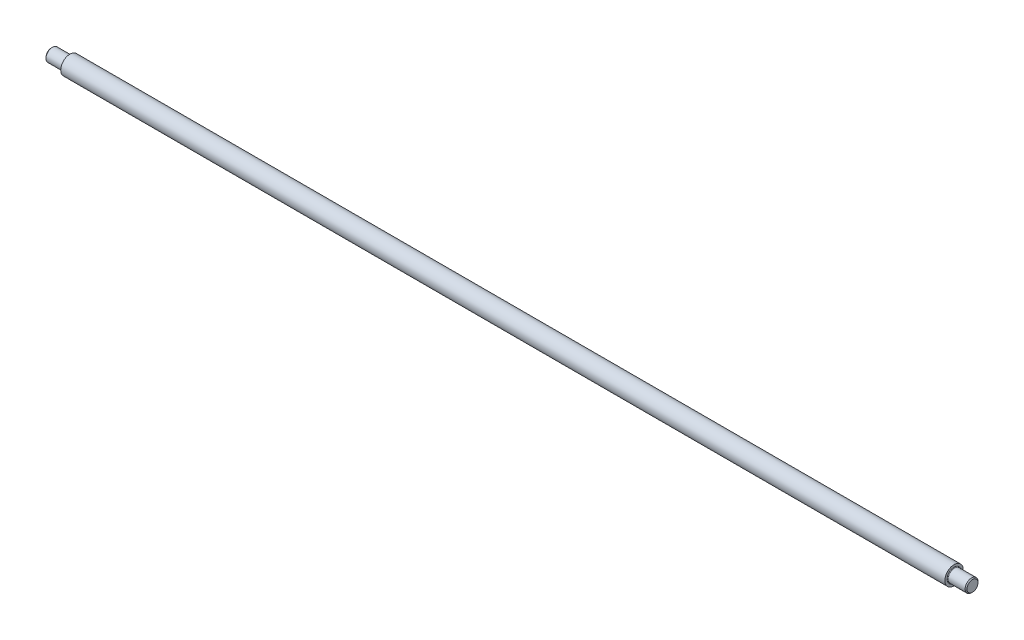
ISO-10303-21;
HEADER;
FILE_DESCRIPTION(('STEP AP214'),'2;1');
FILE_NAME('part.step','',(''),(''),'','','');
FILE_SCHEMA(('AUTOMOTIVE_DESIGN { 1 0 10303 214 1 1 1 1 }'));
ENDSEC;
DATA;
#1=APPLICATION_CONTEXT('core data for automotive mechanical design processes');
#2=APPLICATION_PROTOCOL_DEFINITION('international standard','automotive_design',2000,#1);
#3=PRODUCT_CONTEXT('',#1,'mechanical');
#4=PRODUCT('Part','Part','',(#3));
#5=PRODUCT_RELATED_PRODUCT_CATEGORY('part','',(#4));
#6=PRODUCT_DEFINITION_FORMATION('','',#4);
#7=PRODUCT_DEFINITION_CONTEXT('part definition',#1,'design');
#8=PRODUCT_DEFINITION('design','',#6,#7);
#9=PRODUCT_DEFINITION_SHAPE('','',#8);
#10=(LENGTH_UNIT() NAMED_UNIT(*) SI_UNIT(.MILLI.,.METRE.));
#11=(NAMED_UNIT(*) PLANE_ANGLE_UNIT() SI_UNIT($,.RADIAN.));
#12=(NAMED_UNIT(*) SI_UNIT($,.STERADIAN.) SOLID_ANGLE_UNIT());
#13=UNCERTAINTY_MEASURE_WITH_UNIT(LENGTH_MEASURE(1.E-05),#10,'distance_accuracy_value','');
#14=(GEOMETRIC_REPRESENTATION_CONTEXT(3) GLOBAL_UNCERTAINTY_ASSIGNED_CONTEXT((#13)) GLOBAL_UNIT_ASSIGNED_CONTEXT((#10,
#11,#12)) REPRESENTATION_CONTEXT('',''));
#15=CARTESIAN_POINT('',(0.,0.,0.));
#16=DIRECTION('',(0.,0.,1.));
#17=DIRECTION('',(1.,0.,0.));
#18=AXIS2_PLACEMENT_3D('',#15,#16,#17);
#19=CARTESIAN_POINT('',(10.,-5.,5.));
#20=DIRECTION('',(-1.,0.,0.));
#21=DIRECTION('',(0.,1.,0.));
#22=AXIS2_PLACEMENT_3D('',#19,#20,#21);
#23=PLANE('',#22);
#24=CARTESIAN_POINT('',(10.,0.,0.));
#25=DIRECTION('',(-1.,0.,0.));
#26=DIRECTION('',(0.,0.,-1.));
#27=AXIS2_PLACEMENT_3D('',#24,#25,#26);
#28=CIRCLE('',#27,5.);
#29=CARTESIAN_POINT('',(10.,0.,-5.));
#30=VERTEX_POINT('',#29);
#31=EDGE_CURVE('E50',#30,#30,#28,.F.);
#32=ORIENTED_EDGE('',*,*,#31,.F.);
#33=EDGE_LOOP('',(#32));
#34=FACE_BOUND('',#33,.T.);
#35=CARTESIAN_POINT('',(10.,0.,0.));
#36=DIRECTION('',(1.,0.,0.));
#37=DIRECTION('',(0.,-1.42053919504589E-07,0.99999999999999));
#38=AXIS2_PLACEMENT_3D('',#35,#36,#37);
#39=CIRCLE('',#38,3.79999999999989);
#40=CARTESIAN_POINT('',(10.,-5.39804894117424E-07,3.79999999999985));
#41=VERTEX_POINT('',#40);
#42=EDGE_CURVE('E47',#41,#41,#39,.T.);
#43=ORIENTED_EDGE('',*,*,#42,.T.);
#44=EDGE_LOOP('',(#43));
#45=FACE_BOUND('',#44,.T.);
#46=ADVANCED_FACE('F15',(#34,#45),#23,.T.);
#47=CARTESIAN_POINT('',(490.,-4.99999975829996,-5.00000000000001));
#48=DIRECTION('',(1.,0.,0.));
#49=DIRECTION('',(0.,1.,0.));
#50=AXIS2_PLACEMENT_3D('',#47,#48,#49);
#51=PLANE('',#50);
#52=CARTESIAN_POINT('',(490.,0.,0.));
#53=DIRECTION('',(1.,0.,0.));
#54=DIRECTION('',(0.,-1.41721898572201E-07,0.99999999999999));
#55=AXIS2_PLACEMENT_3D('',#52,#53,#54);
#56=CIRCLE('',#55,5.);
#57=CARTESIAN_POINT('',(490.,-7.08609492861005E-07,4.99999999999995));
#58=VERTEX_POINT('',#57);
#59=EDGE_CURVE('E44',#58,#58,#56,.T.);
#60=ORIENTED_EDGE('',*,*,#59,.T.);
#61=EDGE_LOOP('',(#60));
#62=FACE_BOUND('',#61,.T.);
#63=CARTESIAN_POINT('',(490.,0.,0.));
#64=DIRECTION('',(-1.,0.,0.));
#65=DIRECTION('',(0.,0.,-1.));
#66=AXIS2_PLACEMENT_3D('',#63,#64,#65);
#67=CIRCLE('',#66,3.80000037178537);
#68=CARTESIAN_POINT('',(490.,0.,-3.80000037178537));
#69=VERTEX_POINT('',#68);
#70=EDGE_CURVE('E41',#69,#69,#67,.F.);
#71=ORIENTED_EDGE('',*,*,#70,.F.);
#72=EDGE_LOOP('',(#71));
#73=FACE_BOUND('',#72,.T.);
#74=ADVANCED_FACE('F58',(#62,#73),#51,.T.);
#75=CARTESIAN_POINT('',(0.,-3.,3.));
#76=DIRECTION('',(-1.,0.,0.));
#77=DIRECTION('',(0.,1.,0.));
#78=AXIS2_PLACEMENT_3D('',#75,#76,#77);
#79=PLANE('',#78);
#80=CARTESIAN_POINT('',(0.,0.,0.));
#81=DIRECTION('',(-1.,0.,0.));
#82=DIRECTION('',(0.,0.,-1.));
#83=AXIS2_PLACEMENT_3D('',#80,#81,#82);
#84=CIRCLE('',#83,3.);
#85=CARTESIAN_POINT('',(0.,0.,-3.));
#86=VERTEX_POINT('',#85);
#87=EDGE_CURVE('E38',#86,#86,#84,.F.);
#88=ORIENTED_EDGE('',*,*,#87,.F.);
#89=EDGE_LOOP('',(#88));
#90=FACE_BOUND('',#89,.T.);
#91=ADVANCED_FACE('F81',(#90),#79,.T.);
#92=CARTESIAN_POINT('',(500.,-2.99999985477205,-2.9999999999999));
#93=DIRECTION('',(1.,0.,0.));
#94=DIRECTION('',(0.,1.,0.));
#95=AXIS2_PLACEMENT_3D('',#92,#93,#94);
#96=PLANE('',#95);
#97=CARTESIAN_POINT('',(500.,0.,0.));
#98=DIRECTION('',(1.,0.,0.));
#99=DIRECTION('',(0.,-1.41924996939959E-07,0.99999999999999));
#100=AXIS2_PLACEMENT_3D('',#97,#98,#99);
#101=CIRCLE('',#100,2.9999999999999);
#102=CARTESIAN_POINT('',(500.,-4.25774990819863E-07,2.99999999999987));
#103=VERTEX_POINT('',#102);
#104=EDGE_CURVE('E35',#103,#103,#101,.T.);
#105=ORIENTED_EDGE('',*,*,#104,.T.);
#106=EDGE_LOOP('',(#105));
#107=FACE_BOUND('',#106,.T.);
#108=ADVANCED_FACE('F83',(#107),#96,.T.);
#109=CARTESIAN_POINT('',(490.,0.,0.));
#110=DIRECTION('',(1.,0.,0.));
#111=DIRECTION('',(0.,0.,1.));
#112=AXIS2_PLACEMENT_3D('',#109,#110,#111);
#113=CYLINDRICAL_SURFACE('',#112,5.);
#114=ORIENTED_EDGE('',*,*,#59,.F.);
#115=EDGE_LOOP('',(#114));
#116=FACE_BOUND('',#115,.T.);
#117=ORIENTED_EDGE('',*,*,#31,.T.);
#118=EDGE_LOOP('',(#117));
#119=FACE_BOUND('',#118,.T.);
#120=ADVANCED_FACE('F54',(#116,#119),#113,.T.);
#121=CARTESIAN_POINT('',(0.5,0.,0.));
#122=DIRECTION('',(1.,0.,0.));
#123=DIRECTION('',(0.,1.92336047429162E-10,1.));
#124=AXIS2_PLACEMENT_3D('',#121,#122,#123);
#125=CONICAL_SURFACE('',#124,3.5,0.785398163397448);
#126=CARTESIAN_POINT('',(0.5,0.,0.));
#127=DIRECTION('',(-1.,0.,0.));
#128=DIRECTION('',(0.,0.,-1.));
#129=AXIS2_PLACEMENT_3D('',#126,#127,#128);
#130=CIRCLE('',#129,3.5);
#131=CARTESIAN_POINT('',(0.5,0.,-3.5));
#132=VERTEX_POINT('',#131);
#133=EDGE_CURVE('E30',#132,#132,#130,.F.);
#134=ORIENTED_EDGE('',*,*,#133,.F.);
#135=EDGE_LOOP('',(#134));
#136=FACE_BOUND('',#135,.T.);
#137=ORIENTED_EDGE('',*,*,#87,.T.);
#138=EDGE_LOOP('',(#137));
#139=FACE_BOUND('',#138,.T.);
#140=ADVANCED_FACE('F72',(#136,#139),#125,.T.);
#141=CARTESIAN_POINT('',(10.,0.,0.));
#142=DIRECTION('',(1.,0.,0.));
#143=DIRECTION('',(0.,7.69342934144187E-10,1.));
#144=AXIS2_PLACEMENT_3D('',#141,#142,#143);
#145=CYLINDRICAL_SURFACE('',#144,3.5);
#146=CARTESIAN_POINT('',(9.7,0.,0.));
#147=DIRECTION('',(-1.,0.,0.));
#148=DIRECTION('',(0.,0.,-1.));
#149=AXIS2_PLACEMENT_3D('',#146,#147,#148);
#150=CIRCLE('',#149,3.5);
#151=CARTESIAN_POINT('',(9.7,0.,-3.5));
#152=VERTEX_POINT('',#151);
#153=EDGE_CURVE('E26',#152,#152,#150,.F.);
#154=ORIENTED_EDGE('',*,*,#153,.F.);
#155=EDGE_LOOP('',(#154));
#156=FACE_BOUND('',#155,.T.);
#157=ORIENTED_EDGE('',*,*,#133,.T.);
#158=EDGE_LOOP('',(#157));
#159=FACE_BOUND('',#158,.T.);
#160=ADVANCED_FACE('F66',(#156,#159),#145,.T.);
#161=CARTESIAN_POINT('',(9.70000000000012,0.,0.));
#162=DIRECTION('',(1.,0.,0.));
#163=DIRECTION('',(0.,0.,1.));
#164=AXIS2_PLACEMENT_3D('',#161,#162,#163);
#165=TOROIDAL_SURFACE('',#164,3.79999999999988,0.299999999999876);
#166=ORIENTED_EDGE('',*,*,#42,.F.);
#167=EDGE_LOOP('',(#166));
#168=FACE_BOUND('',#167,.T.);
#169=ORIENTED_EDGE('',*,*,#153,.T.);
#170=EDGE_LOOP('',(#169));
#171=FACE_BOUND('',#170,.T.);
#172=ADVANCED_FACE('F62',(#168,#171),#165,.F.);
#173=CARTESIAN_POINT('',(490.299999999993,0.,0.));
#174=DIRECTION('',(1.,0.,0.));
#175=DIRECTION('',(0.,0.,1.));
#176=AXIS2_PLACEMENT_3D('',#173,#174,#175);
#177=TOROIDAL_SURFACE('',#176,3.79999999999319,0.29999999999325);
#178=CARTESIAN_POINT('',(490.3,0.,0.));
#179=DIRECTION('',(-1.,0.,0.));
#180=DIRECTION('',(0.,0.,-1.));
#181=AXIS2_PLACEMENT_3D('',#178,#179,#180);
#182=CIRCLE('',#181,3.49999999999994);
#183=CARTESIAN_POINT('',(490.3,0.,-3.49999999999994));
#184=VERTEX_POINT('',#183);
#185=EDGE_CURVE('E22',#184,#184,#182,.F.);
#186=ORIENTED_EDGE('',*,*,#185,.F.);
#187=EDGE_LOOP('',(#186));
#188=FACE_BOUND('',#187,.T.);
#189=ORIENTED_EDGE('',*,*,#70,.T.);
#190=EDGE_LOOP('',(#189));
#191=FACE_BOUND('',#190,.T.);
#192=ADVANCED_FACE('F65',(#188,#191),#177,.F.);
#193=CARTESIAN_POINT('',(500.,0.,0.));
#194=DIRECTION('',(1.,0.,0.));
#195=DIRECTION('',(0.,0.,1.));
#196=AXIS2_PLACEMENT_3D('',#193,#194,#195);
#197=CYLINDRICAL_SURFACE('',#196,3.49999999999992);
#198=CARTESIAN_POINT('',(499.5,0.,0.));
#199=DIRECTION('',(-1.,0.,0.));
#200=DIRECTION('',(0.,0.,-1.));
#201=AXIS2_PLACEMENT_3D('',#198,#199,#200);
#202=CIRCLE('',#201,3.49999999999992);
#203=CARTESIAN_POINT('',(499.5,0.,-3.49999999999992));
#204=VERTEX_POINT('',#203);
#205=EDGE_CURVE('E10',#204,#204,#202,.F.);
#206=ORIENTED_EDGE('',*,*,#205,.F.);
#207=EDGE_LOOP('',(#206));
#208=FACE_BOUND('',#207,.T.);
#209=ORIENTED_EDGE('',*,*,#185,.T.);
#210=EDGE_LOOP('',(#209));
#211=FACE_BOUND('',#210,.T.);
#212=ADVANCED_FACE('F99',(#208,#211),#197,.T.);
#213=CARTESIAN_POINT('',(499.5,0.,0.));
#214=DIRECTION('',(-1.,0.,0.));
#215=DIRECTION('',(0.,0.,-1.));
#216=AXIS2_PLACEMENT_3D('',#213,#214,#215);
#217=CONICAL_SURFACE('',#216,3.4999999999999,0.785398163397447);
#218=ORIENTED_EDGE('',*,*,#104,.F.);
#219=EDGE_LOOP('',(#218));
#220=FACE_BOUND('',#219,.T.);
#221=ORIENTED_EDGE('',*,*,#205,.T.);
#222=EDGE_LOOP('',(#221));
#223=FACE_BOUND('',#222,.T.);
#224=ADVANCED_FACE('F17',(#220,#223),#217,.T.);
#225=CLOSED_SHELL('',(#46,#74,#91,#108,#120,#140,#160,#172,#192,#212,#224));
#226=MANIFOLD_SOLID_BREP('B1',#225);
#227=ADVANCED_BREP_SHAPE_REPRESENTATION('',(#18,#226),#14);
#228=SHAPE_DEFINITION_REPRESENTATION(#9,#227);
ENDSEC;
END-ISO-10303-21;
